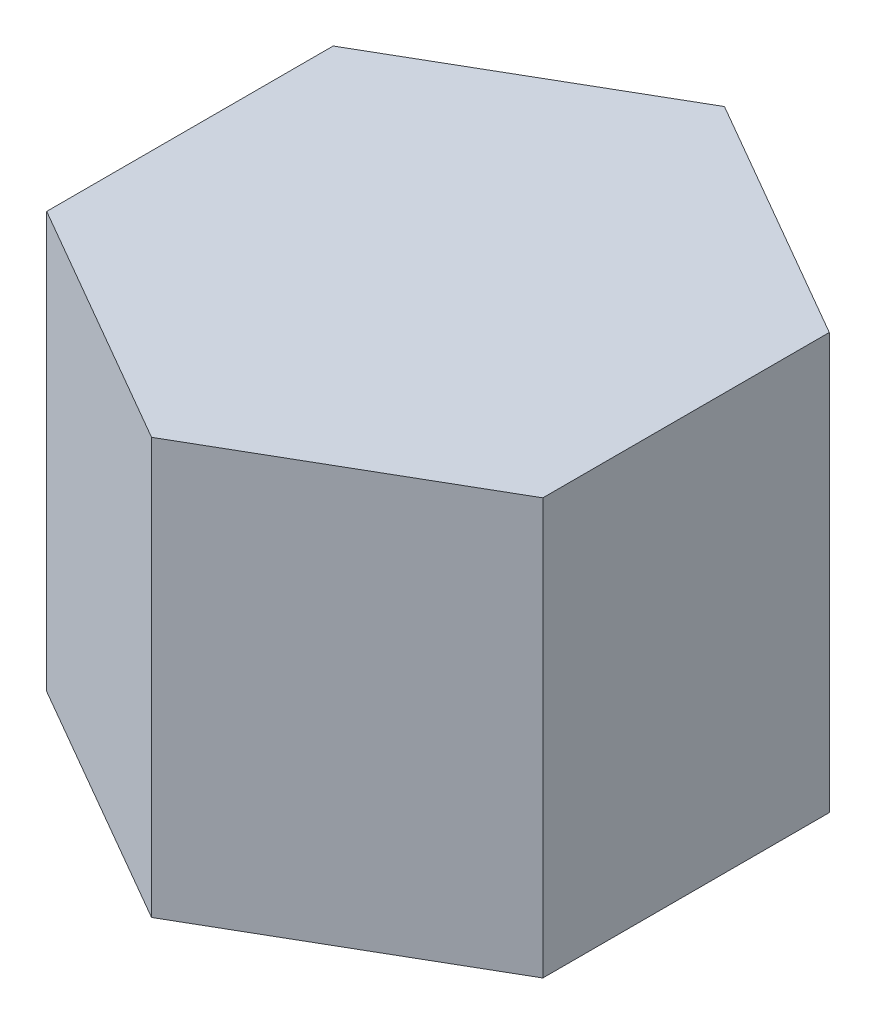
ISO-10303-21;
HEADER;
FILE_DESCRIPTION(('STEP AP214'),'2;1');
FILE_NAME('part.step','',(''),(''),'','','');
FILE_SCHEMA(('AUTOMOTIVE_DESIGN { 1 0 10303 214 1 1 1 1 }'));
ENDSEC;
DATA;
#1=APPLICATION_CONTEXT('core data for automotive mechanical design processes');
#2=APPLICATION_PROTOCOL_DEFINITION('international standard','automotive_design',2000,#1);
#3=PRODUCT_CONTEXT('',#1,'mechanical');
#4=PRODUCT('Part','Part','',(#3));
#5=PRODUCT_RELATED_PRODUCT_CATEGORY('part','',(#4));
#6=PRODUCT_DEFINITION_FORMATION('','',#4);
#7=PRODUCT_DEFINITION_CONTEXT('part definition',#1,'design');
#8=PRODUCT_DEFINITION('design','',#6,#7);
#9=PRODUCT_DEFINITION_SHAPE('','',#8);
#10=(LENGTH_UNIT() NAMED_UNIT(*) SI_UNIT(.MILLI.,.METRE.));
#11=(NAMED_UNIT(*) PLANE_ANGLE_UNIT() SI_UNIT($,.RADIAN.));
#12=(NAMED_UNIT(*) SI_UNIT($,.STERADIAN.) SOLID_ANGLE_UNIT());
#13=UNCERTAINTY_MEASURE_WITH_UNIT(LENGTH_MEASURE(1.E-05),#10,'distance_accuracy_value','');
#14=(GEOMETRIC_REPRESENTATION_CONTEXT(3) GLOBAL_UNCERTAINTY_ASSIGNED_CONTEXT((#13)) GLOBAL_UNIT_ASSIGNED_CONTEXT((#10,
#11,#12)) REPRESENTATION_CONTEXT('',''));
#15=CARTESIAN_POINT('',(0.,0.,0.));
#16=DIRECTION('',(0.,0.,1.));
#17=DIRECTION('',(1.,0.,0.));
#18=AXIS2_PLACEMENT_3D('',#15,#16,#17);
#19=CARTESIAN_POINT('',(206.142660308706,-148.537700895744,288.908895009141));
#20=DIRECTION('',(-0.499999999999943,0.,-0.866025403784472));
#21=DIRECTION('',(-0.866025403784472,0.,0.499999999999943));
#22=AXIS2_PLACEMENT_3D('',#19,#20,#21);
#23=PLANE('',#22);
#24=CARTESIAN_POINT('',(205.839551417382,-149.045793579175,289.083895009141));
#25=DIRECTION('',(0.866025403784471,0.,-0.499999999999943));
#26=VECTOR('',#25,1.);
#27=LINE('',#24,#26);
#28=CARTESIAN_POINT('',(205.839551417382,-149.045793579175,289.083895009141));
#29=VERTEX_POINT('',#28);
#30=CARTESIAN_POINT('',(206.142660308706,-149.045793579175,288.908895009141));
#31=VERTEX_POINT('',#30);
#32=EDGE_CURVE('E170',#29,#31,#27,.T.);
#33=ORIENTED_EDGE('',*,*,#32,.T.);
#34=CARTESIAN_POINT('',(206.142660308706,-148.537700895744,288.908895009141));
#35=DIRECTION('',(0.,-1.,0.));
#36=VECTOR('',#35,1.);
#37=LINE('',#34,#36);
#38=CARTESIAN_POINT('',(206.142660308706,-148.537700895744,288.908895009141));
#39=VERTEX_POINT('',#38);
#40=EDGE_CURVE('E35',#39,#31,#37,.T.);
#41=ORIENTED_EDGE('',*,*,#40,.F.);
#42=CARTESIAN_POINT('',(205.839551417382,-148.537700895744,289.083895009141));
#43=DIRECTION('',(0.866025403784471,0.,-0.499999999999943));
#44=VECTOR('',#43,1.);
#45=LINE('',#42,#44);
#46=CARTESIAN_POINT('',(205.839551417382,-148.537700895744,289.083895009141));
#47=VERTEX_POINT('',#46);
#48=EDGE_CURVE('E159',#47,#39,#45,.T.);
#49=ORIENTED_EDGE('',*,*,#48,.F.);
#50=CARTESIAN_POINT('',(205.839551417382,-148.537700895744,289.083895009141));
#51=DIRECTION('',(0.,-1.,0.));
#52=VECTOR('',#51,1.);
#53=LINE('',#50,#52);
#54=EDGE_CURVE('E10',#47,#29,#53,.T.);
#55=ORIENTED_EDGE('',*,*,#54,.T.);
#56=EDGE_LOOP('',(#33,#41,#49,#55));
#57=FACE_BOUND('',#56,.T.);
#58=ADVANCED_FACE('F16',(#57),#23,.F.);
#59=CARTESIAN_POINT('',(205.839551417382,-148.537700895744,289.083895009141));
#60=DIRECTION('',(0.500000000000062,0.,-0.866025403784403));
#61=DIRECTION('',(-0.866025403784403,0.,-0.500000000000062));
#62=AXIS2_PLACEMENT_3D('',#59,#60,#61);
#63=PLANE('',#62);
#64=CARTESIAN_POINT('',(205.536442526057,-149.045793579175,288.908895009141));
#65=DIRECTION('',(0.866025403784403,0.,0.500000000000062));
#66=VECTOR('',#65,1.);
#67=LINE('',#64,#66);
#68=CARTESIAN_POINT('',(205.536442526057,-149.045793579175,288.908895009141));
#69=VERTEX_POINT('',#68);
#70=EDGE_CURVE('E167',#69,#29,#67,.T.);
#71=ORIENTED_EDGE('',*,*,#70,.T.);
#72=ORIENTED_EDGE('',*,*,#54,.F.);
#73=CARTESIAN_POINT('',(205.536442526057,-148.537700895744,288.908895009141));
#74=DIRECTION('',(0.866025403784403,0.,0.500000000000062));
#75=VECTOR('',#74,1.);
#76=LINE('',#73,#75);
#77=CARTESIAN_POINT('',(205.536442526057,-148.537700895744,288.908895009141));
#78=VERTEX_POINT('',#77);
#79=EDGE_CURVE('E156',#78,#47,#76,.T.);
#80=ORIENTED_EDGE('',*,*,#79,.F.);
#81=CARTESIAN_POINT('',(205.536442526057,-148.537700895744,288.908895009141));
#82=DIRECTION('',(0.,-1.,0.));
#83=VECTOR('',#82,1.);
#84=LINE('',#81,#83);
#85=EDGE_CURVE('E27',#78,#69,#84,.T.);
#86=ORIENTED_EDGE('',*,*,#85,.T.);
#87=EDGE_LOOP('',(#71,#72,#80,#86));
#88=FACE_BOUND('',#87,.T.);
#89=ADVANCED_FACE('F189',(#88),#63,.F.);
#90=CARTESIAN_POINT('',(205.536442526057,-148.537700895744,290.831971220494));
#91=DIRECTION('',(1.,0.,0.));
#92=DIRECTION('',(0.,1.,0.));
#93=AXIS2_PLACEMENT_3D('',#90,#91,#92);
#94=PLANE('',#93);
#95=CARTESIAN_POINT('',(205.536442526057,-149.045793579175,288.558895009141));
#96=DIRECTION('',(0.,0.,1.));
#97=VECTOR('',#96,1.);
#98=LINE('',#95,#97);
#99=CARTESIAN_POINT('',(205.536442526057,-149.045793579175,288.558895009141));
#100=VERTEX_POINT('',#99);
#101=EDGE_CURVE('E163',#100,#69,#98,.T.);
#102=ORIENTED_EDGE('',*,*,#101,.T.);
#103=ORIENTED_EDGE('',*,*,#85,.F.);
#104=CARTESIAN_POINT('',(205.536442526057,-148.537700895744,288.558895009141));
#105=DIRECTION('',(0.,0.,1.));
#106=VECTOR('',#105,1.);
#107=LINE('',#104,#106);
#108=CARTESIAN_POINT('',(205.536442526057,-148.537700895744,288.558895009141));
#109=VERTEX_POINT('',#108);
#110=EDGE_CURVE('E106',#109,#78,#107,.T.);
#111=ORIENTED_EDGE('',*,*,#110,.F.);
#112=CARTESIAN_POINT('',(205.536442526057,-148.537700895744,288.558895009141));
#113=DIRECTION('',(0.,-1.,0.));
#114=VECTOR('',#113,1.);
#115=LINE('',#112,#114);
#116=EDGE_CURVE('E94',#109,#100,#115,.T.);
#117=ORIENTED_EDGE('',*,*,#116,.T.);
#118=EDGE_LOOP('',(#102,#103,#111,#117));
#119=FACE_BOUND('',#118,.T.);
#120=ADVANCED_FACE('F198',(#119),#94,.F.);
#121=CARTESIAN_POINT('',(205.536442526057,-148.537700895744,288.558895009141));
#122=DIRECTION('',(0.499999999999978,0.,0.866025403784452));
#123=DIRECTION('',(0.866025403784452,0.,-0.499999999999978));
#124=AXIS2_PLACEMENT_3D('',#121,#122,#123);
#125=PLANE('',#124);
#126=CARTESIAN_POINT('',(205.839551417382,-149.045793579175,288.383895009141));
#127=DIRECTION('',(-0.866025403784452,0.,0.499999999999978));
#128=VECTOR('',#127,1.);
#129=LINE('',#126,#128);
#130=CARTESIAN_POINT('',(205.839551417382,-149.045793579175,288.383895009141));
#131=VERTEX_POINT('',#130);
#132=EDGE_CURVE('E162',#131,#100,#129,.T.);
#133=ORIENTED_EDGE('',*,*,#132,.T.);
#134=ORIENTED_EDGE('',*,*,#116,.F.);
#135=CARTESIAN_POINT('',(205.839551417382,-148.537700895744,288.383895009141));
#136=DIRECTION('',(-0.866025403784452,0.,0.499999999999978));
#137=VECTOR('',#136,1.);
#138=LINE('',#135,#137);
#139=CARTESIAN_POINT('',(205.839551417382,-148.537700895744,288.383895009141));
#140=VERTEX_POINT('',#139);
#141=EDGE_CURVE('E98',#140,#109,#138,.T.);
#142=ORIENTED_EDGE('',*,*,#141,.F.);
#143=CARTESIAN_POINT('',(205.839551417382,-148.537700895744,288.383895009141));
#144=DIRECTION('',(0.,-1.,0.));
#145=VECTOR('',#144,1.);
#146=LINE('',#143,#145);
#147=EDGE_CURVE('E79',#140,#131,#146,.T.);
#148=ORIENTED_EDGE('',*,*,#147,.T.);
#149=EDGE_LOOP('',(#133,#134,#142,#148));
#150=FACE_BOUND('',#149,.T.);
#151=ADVANCED_FACE('F100',(#150),#125,.F.);
#152=CARTESIAN_POINT('',(205.839551417382,-148.537700895744,288.383895009141));
#153=DIRECTION('',(-0.499999999999943,0.,0.866025403784472));
#154=DIRECTION('',(0.866025403784472,0.,0.499999999999943));
#155=AXIS2_PLACEMENT_3D('',#152,#153,#154);
#156=PLANE('',#155);
#157=CARTESIAN_POINT('',(206.142660308706,-149.045793579175,288.558895009141));
#158=DIRECTION('',(-0.866025403784471,0.,-0.499999999999943));
#159=VECTOR('',#158,1.);
#160=LINE('',#157,#159);
#161=CARTESIAN_POINT('',(206.142660308706,-149.045793579175,288.558895009141));
#162=VERTEX_POINT('',#161);
#163=EDGE_CURVE('E88',#162,#131,#160,.T.);
#164=ORIENTED_EDGE('',*,*,#163,.T.);
#165=ORIENTED_EDGE('',*,*,#147,.F.);
#166=CARTESIAN_POINT('',(206.142660308706,-148.537700895744,288.558895009141));
#167=DIRECTION('',(-0.866025403784471,0.,-0.499999999999943));
#168=VECTOR('',#167,1.);
#169=LINE('',#166,#168);
#170=CARTESIAN_POINT('',(206.142660308706,-148.537700895744,288.558895009141));
#171=VERTEX_POINT('',#170);
#172=EDGE_CURVE('E84',#171,#140,#169,.T.);
#173=ORIENTED_EDGE('',*,*,#172,.F.);
#174=CARTESIAN_POINT('',(206.142660308706,-148.537700895744,288.558895009141));
#175=DIRECTION('',(0.,-1.,0.));
#176=VECTOR('',#175,1.);
#177=LINE('',#174,#176);
#178=EDGE_CURVE('E58',#171,#162,#177,.T.);
#179=ORIENTED_EDGE('',*,*,#178,.T.);
#180=EDGE_LOOP('',(#164,#165,#173,#179));
#181=FACE_BOUND('',#180,.T.);
#182=ADVANCED_FACE('F82',(#181),#156,.F.);
#183=CARTESIAN_POINT('',(206.142660308706,-148.537700895744,290.831971220494));
#184=DIRECTION('',(-1.,0.,0.));
#185=DIRECTION('',(0.,-1.,0.));
#186=AXIS2_PLACEMENT_3D('',#183,#184,#185);
#187=PLANE('',#186);
#188=CARTESIAN_POINT('',(206.142660308706,-149.045793579175,288.908895009141));
#189=DIRECTION('',(0.,0.,-1.));
#190=VECTOR('',#189,1.);
#191=LINE('',#188,#190);
#192=EDGE_CURVE('E160',#31,#162,#191,.T.);
#193=ORIENTED_EDGE('',*,*,#192,.T.);
#194=ORIENTED_EDGE('',*,*,#178,.F.);
#195=CARTESIAN_POINT('',(206.142660308706,-148.537700895744,288.908895009141));
#196=DIRECTION('',(0.,0.,-1.));
#197=VECTOR('',#196,1.);
#198=LINE('',#195,#197);
#199=EDGE_CURVE('E112',#39,#171,#198,.T.);
#200=ORIENTED_EDGE('',*,*,#199,.F.);
#201=ORIENTED_EDGE('',*,*,#40,.T.);
#202=EDGE_LOOP('',(#193,#194,#200,#201));
#203=FACE_BOUND('',#202,.T.);
#204=ADVANCED_FACE('F131',(#203),#187,.F.);
#205=CARTESIAN_POINT('',(206.339551417382,-148.537700895744,290.831971220494));
#206=DIRECTION('',(0.,-1.,0.));
#207=DIRECTION('',(1.,0.,0.));
#208=AXIS2_PLACEMENT_3D('',#205,#206,#207);
#209=PLANE('',#208);
#210=ORIENTED_EDGE('',*,*,#48,.T.);
#211=ORIENTED_EDGE('',*,*,#199,.T.);
#212=ORIENTED_EDGE('',*,*,#172,.T.);
#213=ORIENTED_EDGE('',*,*,#141,.T.);
#214=ORIENTED_EDGE('',*,*,#110,.T.);
#215=ORIENTED_EDGE('',*,*,#79,.T.);
#216=EDGE_LOOP('',(#210,#211,#212,#213,#214,#215));
#217=FACE_BOUND('',#216,.T.);
#218=ADVANCED_FACE('F111',(#217),#209,.F.);
#219=CARTESIAN_POINT('',(206.339551417382,-149.045793579175,290.831971220494));
#220=DIRECTION('',(0.,-1.,0.));
#221=DIRECTION('',(1.,0.,0.));
#222=AXIS2_PLACEMENT_3D('',#219,#220,#221);
#223=PLANE('',#222);
#224=ORIENTED_EDGE('',*,*,#32,.F.);
#225=ORIENTED_EDGE('',*,*,#70,.F.);
#226=ORIENTED_EDGE('',*,*,#101,.F.);
#227=ORIENTED_EDGE('',*,*,#132,.F.);
#228=ORIENTED_EDGE('',*,*,#163,.F.);
#229=ORIENTED_EDGE('',*,*,#192,.F.);
#230=EDGE_LOOP('',(#224,#225,#226,#227,#228,#229));
#231=FACE_BOUND('',#230,.T.);
#232=ADVANCED_FACE('F130',(#231),#223,.T.);
#233=CLOSED_SHELL('',(#58,#89,#120,#151,#182,#204,#218,#232));
#234=MANIFOLD_SOLID_BREP('B1',#233);
#235=ADVANCED_BREP_SHAPE_REPRESENTATION('',(#18,#234),#14);
#236=SHAPE_DEFINITION_REPRESENTATION(#9,#235);
ENDSEC;
END-ISO-10303-21;
